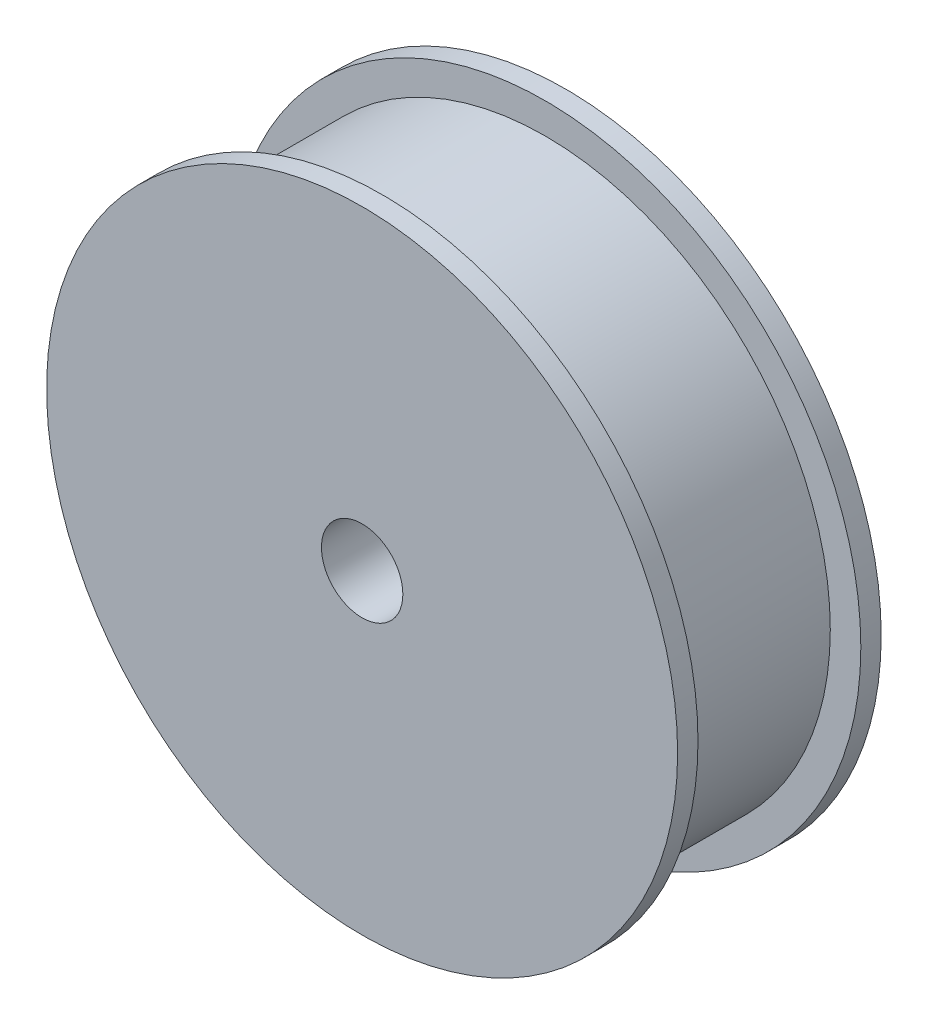
ISO-10303-21;
HEADER;
FILE_DESCRIPTION(('STEP AP214'),'2;1');
FILE_NAME('part.step','',(''),(''),'','','');
FILE_SCHEMA(('AUTOMOTIVE_DESIGN { 1 0 10303 214 1 1 1 1 }'));
ENDSEC;
DATA;
#1=APPLICATION_CONTEXT('core data for automotive mechanical design processes');
#2=APPLICATION_PROTOCOL_DEFINITION('international standard','automotive_design',2000,#1);
#3=PRODUCT_CONTEXT('',#1,'mechanical');
#4=PRODUCT('Part','Part','',(#3));
#5=PRODUCT_RELATED_PRODUCT_CATEGORY('part','',(#4));
#6=PRODUCT_DEFINITION_FORMATION('','',#4);
#7=PRODUCT_DEFINITION_CONTEXT('part definition',#1,'design');
#8=PRODUCT_DEFINITION('design','',#6,#7);
#9=PRODUCT_DEFINITION_SHAPE('','',#8);
#10=(LENGTH_UNIT() NAMED_UNIT(*) SI_UNIT(.MILLI.,.METRE.));
#11=(NAMED_UNIT(*) PLANE_ANGLE_UNIT() SI_UNIT($,.RADIAN.));
#12=(NAMED_UNIT(*) SI_UNIT($,.STERADIAN.) SOLID_ANGLE_UNIT());
#13=UNCERTAINTY_MEASURE_WITH_UNIT(LENGTH_MEASURE(1.E-05),#10,'distance_accuracy_value','');
#14=(GEOMETRIC_REPRESENTATION_CONTEXT(3) GLOBAL_UNCERTAINTY_ASSIGNED_CONTEXT((#13)) GLOBAL_UNIT_ASSIGNED_CONTEXT((#10,
#11,#12)) REPRESENTATION_CONTEXT('',''));
#15=CARTESIAN_POINT('',(0.,0.,0.));
#16=DIRECTION('',(0.,0.,1.));
#17=DIRECTION('',(1.,0.,0.));
#18=AXIS2_PLACEMENT_3D('',#15,#16,#17);
#19=CARTESIAN_POINT('',(0.,0.,20.));
#20=DIRECTION('',(0.,0.,-1.));
#21=DIRECTION('',(-1.,0.,0.));
#22=AXIS2_PLACEMENT_3D('',#19,#20,#21);
#23=CYLINDRICAL_SURFACE('',#22,31.);
#24=CARTESIAN_POINT('',(0.,0.,18.));
#25=DIRECTION('',(0.,0.,1.));
#26=DIRECTION('',(1.,0.,0.));
#27=AXIS2_PLACEMENT_3D('',#24,#25,#26);
#28=CIRCLE('',#27,31.);
#29=CARTESIAN_POINT('',(31.,0.,18.));
#30=VERTEX_POINT('',#29);
#31=EDGE_CURVE('E57',#30,#30,#28,.T.);
#32=ORIENTED_EDGE('',*,*,#31,.T.);
#33=EDGE_LOOP('',(#32));
#34=FACE_BOUND('',#33,.T.);
#35=CARTESIAN_POINT('',(0.,0.,20.));
#36=DIRECTION('',(0.,0.,1.));
#37=DIRECTION('',(1.,0.,0.));
#38=AXIS2_PLACEMENT_3D('',#35,#36,#37);
#39=CIRCLE('',#38,31.);
#40=CARTESIAN_POINT('',(31.,0.,20.));
#41=VERTEX_POINT('',#40);
#42=EDGE_CURVE('E10',#41,#41,#39,.T.);
#43=ORIENTED_EDGE('',*,*,#42,.F.);
#44=EDGE_LOOP('',(#43));
#45=FACE_BOUND('',#44,.T.);
#46=ADVANCED_FACE('F45',(#34,#45),#23,.T.);
#47=CARTESIAN_POINT('',(0.,0.,20.));
#48=DIRECTION('',(0.,0.,1.));
#49=DIRECTION('',(1.,0.,0.));
#50=AXIS2_PLACEMENT_3D('',#47,#48,#49);
#51=PLANE('',#50);
#52=CARTESIAN_POINT('',(0.,0.,20.));
#53=DIRECTION('',(0.,0.,1.));
#54=DIRECTION('',(1.,0.,0.));
#55=AXIS2_PLACEMENT_3D('',#52,#53,#54);
#56=CIRCLE('',#55,4.);
#57=CARTESIAN_POINT('',(4.,0.,20.));
#58=VERTEX_POINT('',#57);
#59=EDGE_CURVE('E75',#58,#58,#56,.T.);
#60=ORIENTED_EDGE('',*,*,#59,.F.);
#61=EDGE_LOOP('',(#60));
#62=FACE_BOUND('',#61,.T.);
#63=ORIENTED_EDGE('',*,*,#42,.T.);
#64=EDGE_LOOP('',(#63));
#65=FACE_BOUND('',#64,.T.);
#66=ADVANCED_FACE('F93',(#62,#65),#51,.T.);
#67=CARTESIAN_POINT('',(0.,0.,18.));
#68=DIRECTION('',(0.,0.,1.));
#69=DIRECTION('',(1.,0.,0.));
#70=AXIS2_PLACEMENT_3D('',#67,#68,#69);
#71=PLANE('',#70);
#72=ORIENTED_EDGE('',*,*,#31,.F.);
#73=EDGE_LOOP('',(#72));
#74=FACE_BOUND('',#73,.T.);
#75=CARTESIAN_POINT('',(0.,0.,18.));
#76=DIRECTION('',(0.,0.,1.));
#77=DIRECTION('',(1.,0.,0.));
#78=AXIS2_PLACEMENT_3D('',#75,#76,#77);
#79=CIRCLE('',#78,28.);
#80=CARTESIAN_POINT('',(28.,0.,18.));
#81=VERTEX_POINT('',#80);
#82=EDGE_CURVE('E63',#81,#81,#79,.T.);
#83=ORIENTED_EDGE('',*,*,#82,.T.);
#84=EDGE_LOOP('',(#83));
#85=FACE_BOUND('',#84,.T.);
#86=ADVANCED_FACE('F95',(#74,#85),#71,.F.);
#87=CARTESIAN_POINT('',(0.,0.,2.));
#88=DIRECTION('',(0.,0.,1.));
#89=DIRECTION('',(1.,0.,0.));
#90=AXIS2_PLACEMENT_3D('',#87,#88,#89);
#91=PLANE('',#90);
#92=CARTESIAN_POINT('',(0.,0.,2.));
#93=DIRECTION('',(0.,0.,1.));
#94=DIRECTION('',(1.,0.,0.));
#95=AXIS2_PLACEMENT_3D('',#92,#93,#94);
#96=CIRCLE('',#95,31.);
#97=CARTESIAN_POINT('',(31.,0.,2.));
#98=VERTEX_POINT('',#97);
#99=EDGE_CURVE('E59',#98,#98,#96,.T.);
#100=ORIENTED_EDGE('',*,*,#99,.T.);
#101=EDGE_LOOP('',(#100));
#102=FACE_BOUND('',#101,.T.);
#103=CARTESIAN_POINT('',(0.,0.,2.));
#104=DIRECTION('',(0.,0.,1.));
#105=DIRECTION('',(1.,0.,0.));
#106=AXIS2_PLACEMENT_3D('',#103,#104,#105);
#107=CIRCLE('',#106,28.);
#108=CARTESIAN_POINT('',(28.,0.,2.));
#109=VERTEX_POINT('',#108);
#110=EDGE_CURVE('E67',#109,#109,#107,.T.);
#111=ORIENTED_EDGE('',*,*,#110,.F.);
#112=EDGE_LOOP('',(#111));
#113=FACE_BOUND('',#112,.T.);
#114=ADVANCED_FACE('F102',(#102,#113),#91,.T.);
#115=CARTESIAN_POINT('',(0.,0.,18.));
#116=DIRECTION('',(0.,0.,-1.));
#117=DIRECTION('',(-1.,0.,0.));
#118=AXIS2_PLACEMENT_3D('',#115,#116,#117);
#119=CYLINDRICAL_SURFACE('',#118,28.);
#120=ORIENTED_EDGE('',*,*,#82,.F.);
#121=EDGE_LOOP('',(#120));
#122=FACE_BOUND('',#121,.T.);
#123=ORIENTED_EDGE('',*,*,#110,.T.);
#124=EDGE_LOOP('',(#123));
#125=FACE_BOUND('',#124,.T.);
#126=ADVANCED_FACE('F108',(#122,#125),#119,.T.);
#127=CARTESIAN_POINT('',(0.,0.,0.));
#128=DIRECTION('',(0.,0.,1.));
#129=DIRECTION('',(1.,0.,0.));
#130=AXIS2_PLACEMENT_3D('',#127,#128,#129);
#131=PLANE('',#130);
#132=CARTESIAN_POINT('',(0.,0.,0.));
#133=DIRECTION('',(0.,0.,1.));
#134=DIRECTION('',(1.,0.,0.));
#135=AXIS2_PLACEMENT_3D('',#132,#133,#134);
#136=CIRCLE('',#135,4.);
#137=CARTESIAN_POINT('',(4.,0.,0.));
#138=VERTEX_POINT('',#137);
#139=EDGE_CURVE('E71',#138,#138,#136,.T.);
#140=ORIENTED_EDGE('',*,*,#139,.T.);
#141=EDGE_LOOP('',(#140));
#142=FACE_BOUND('',#141,.T.);
#143=CARTESIAN_POINT('',(0.,0.,0.));
#144=DIRECTION('',(0.,0.,1.));
#145=DIRECTION('',(1.,0.,0.));
#146=AXIS2_PLACEMENT_3D('',#143,#144,#145);
#147=CIRCLE('',#146,31.);
#148=CARTESIAN_POINT('',(31.,0.,0.));
#149=VERTEX_POINT('',#148);
#150=EDGE_CURVE('E48',#149,#149,#147,.T.);
#151=ORIENTED_EDGE('',*,*,#150,.F.);
#152=EDGE_LOOP('',(#151));
#153=FACE_BOUND('',#152,.T.);
#154=ADVANCED_FACE('F83',(#142,#153),#131,.F.);
#155=ORIENTED_EDGE('',*,*,#150,.T.);
#156=EDGE_LOOP('',(#155));
#157=FACE_BOUND('',#156,.T.);
#158=ORIENTED_EDGE('',*,*,#99,.F.);
#159=EDGE_LOOP('',(#158));
#160=FACE_BOUND('',#159,.T.);
#161=ADVANCED_FACE('F89',(#157,#160),#23,.T.);
#162=CARTESIAN_POINT('',(0.,0.,0.));
#163=DIRECTION('',(0.,0.,1.));
#164=DIRECTION('',(1.,0.,0.));
#165=AXIS2_PLACEMENT_3D('',#162,#163,#164);
#166=CYLINDRICAL_SURFACE('',#165,4.);
#167=ORIENTED_EDGE('',*,*,#139,.F.);
#168=EDGE_LOOP('',(#167));
#169=FACE_BOUND('',#168,.T.);
#170=ORIENTED_EDGE('',*,*,#59,.T.);
#171=EDGE_LOOP('',(#170));
#172=FACE_BOUND('',#171,.T.);
#173=ADVANCED_FACE('F86',(#169,#172),#166,.F.);
#174=CLOSED_SHELL('',(#46,#66,#86,#114,#126,#154,#161,#173));
#175=MANIFOLD_SOLID_BREP('B2',#174);
#176=ADVANCED_BREP_SHAPE_REPRESENTATION('',(#18,#175),#14);
#177=SHAPE_DEFINITION_REPRESENTATION(#9,#176);
ENDSEC;
END-ISO-10303-21;
